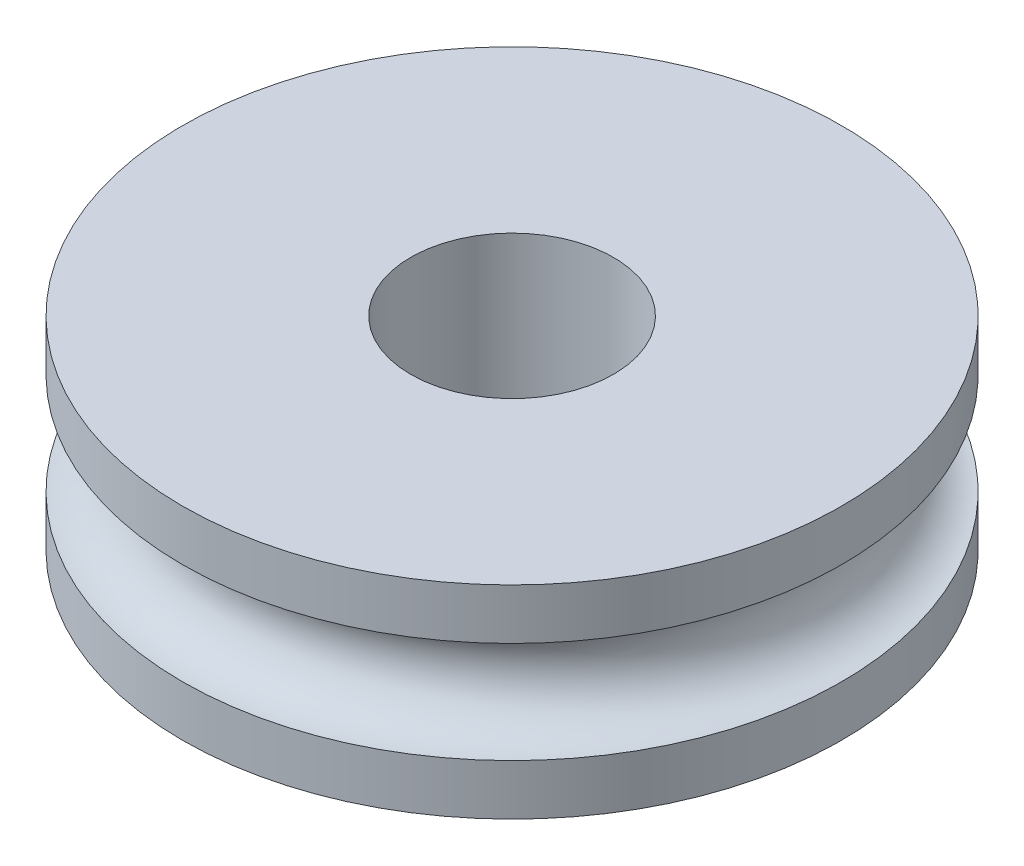
ISO-10303-21;
HEADER;
FILE_DESCRIPTION(('STEP AP214'),'2;1');
FILE_NAME('part.step','',(''),(''),'','','');
FILE_SCHEMA(('AUTOMOTIVE_DESIGN { 1 0 10303 214 1 1 1 1 }'));
ENDSEC;
DATA;
#1=APPLICATION_CONTEXT('core data for automotive mechanical design processes');
#2=APPLICATION_PROTOCOL_DEFINITION('international standard','automotive_design',2000,#1);
#3=PRODUCT_CONTEXT('',#1,'mechanical');
#4=PRODUCT('Part','Part','',(#3));
#5=PRODUCT_RELATED_PRODUCT_CATEGORY('part','',(#4));
#6=PRODUCT_DEFINITION_FORMATION('','',#4);
#7=PRODUCT_DEFINITION_CONTEXT('part definition',#1,'design');
#8=PRODUCT_DEFINITION('design','',#6,#7);
#9=PRODUCT_DEFINITION_SHAPE('','',#8);
#10=(LENGTH_UNIT() NAMED_UNIT(*) SI_UNIT(.MILLI.,.METRE.));
#11=(NAMED_UNIT(*) PLANE_ANGLE_UNIT() SI_UNIT($,.RADIAN.));
#12=(NAMED_UNIT(*) SI_UNIT($,.STERADIAN.) SOLID_ANGLE_UNIT());
#13=UNCERTAINTY_MEASURE_WITH_UNIT(LENGTH_MEASURE(1.E-05),#10,'distance_accuracy_value','');
#14=(GEOMETRIC_REPRESENTATION_CONTEXT(3) GLOBAL_UNCERTAINTY_ASSIGNED_CONTEXT((#13)) GLOBAL_UNIT_ASSIGNED_CONTEXT((#10,
#11,#12)) REPRESENTATION_CONTEXT('',''));
#15=CARTESIAN_POINT('',(0.,0.,0.));
#16=DIRECTION('',(0.,0.,1.));
#17=DIRECTION('',(1.,0.,0.));
#18=AXIS2_PLACEMENT_3D('',#15,#16,#17);
#19=CARTESIAN_POINT('',(74.5,50.02643198464,-44.43));
#20=DIRECTION('',(0.,1.,0.));
#21=DIRECTION('',(0.,0.,1.));
#22=AXIS2_PLACEMENT_3D('',#19,#20,#21);
#23=CYLINDRICAL_SURFACE('',#22,6.50000000000001);
#24=CARTESIAN_POINT('',(74.5,54.52643198464,-44.43));
#25=DIRECTION('',(0.,1.,0.));
#26=DIRECTION('',(0.,0.,1.));
#27=AXIS2_PLACEMENT_3D('',#24,#25,#26);
#28=CIRCLE('',#27,6.50000000000001);
#29=CARTESIAN_POINT('',(74.5,54.52643198464,-37.93));
#30=VERTEX_POINT('',#29);
#31=EDGE_CURVE('E19',#30,#30,#28,.F.);
#32=ORIENTED_EDGE('',*,*,#31,.T.);
#33=EDGE_LOOP('',(#32));
#34=FACE_BOUND('',#33,.T.);
#35=CARTESIAN_POINT('',(74.5,53.52643198464,-44.43));
#36=DIRECTION('',(0.,1.,0.));
#37=DIRECTION('',(0.,0.,1.));
#38=AXIS2_PLACEMENT_3D('',#35,#36,#37);
#39=CIRCLE('',#38,6.50000000000001);
#40=CARTESIAN_POINT('',(74.5,53.52643198464,-37.93));
#41=VERTEX_POINT('',#40);
#42=EDGE_CURVE('E34',#41,#41,#39,.T.);
#43=ORIENTED_EDGE('',*,*,#42,.T.);
#44=EDGE_LOOP('',(#43));
#45=FACE_BOUND('',#44,.T.);
#46=ADVANCED_FACE('F16',(#34,#45),#23,.T.);
#47=CARTESIAN_POINT('',(74.5,52.52643198464,-44.43));
#48=DIRECTION('',(0.,1.,0.));
#49=DIRECTION('',(1.,0.,0.));
#50=AXIS2_PLACEMENT_3D('',#47,#48,#49);
#51=TOROIDAL_SURFACE('',#50,6.50000000000001,1.);
#52=ORIENTED_EDGE('',*,*,#42,.F.);
#53=EDGE_LOOP('',(#52));
#54=FACE_BOUND('',#53,.T.);
#55=CARTESIAN_POINT('',(74.5,51.52643198464,-44.43));
#56=DIRECTION('',(0.,1.,0.));
#57=DIRECTION('',(0.,0.,1.));
#58=AXIS2_PLACEMENT_3D('',#55,#56,#57);
#59=CIRCLE('',#58,6.50000000000001);
#60=CARTESIAN_POINT('',(74.5,51.52643198464,-37.93));
#61=VERTEX_POINT('',#60);
#62=EDGE_CURVE('E38',#61,#61,#59,.F.);
#63=ORIENTED_EDGE('',*,*,#62,.F.);
#64=EDGE_LOOP('',(#63));
#65=FACE_BOUND('',#64,.T.);
#66=ADVANCED_FACE('F49',(#54,#65),#51,.F.);
#67=CARTESIAN_POINT('',(83.5,54.52643198464,-52.35926627001));
#68=DIRECTION('',(0.,-1.,0.));
#69=DIRECTION('',(0.,0.,-1.));
#70=AXIS2_PLACEMENT_3D('',#67,#68,#69);
#71=PLANE('',#70);
#72=CARTESIAN_POINT('',(74.5,54.52643198464,-44.43));
#73=DIRECTION('',(0.,1.,0.));
#74=DIRECTION('',(0.,0.,1.));
#75=AXIS2_PLACEMENT_3D('',#72,#73,#74);
#76=CIRCLE('',#75,2.);
#77=CARTESIAN_POINT('',(74.5,54.52643198464,-42.43));
#78=VERTEX_POINT('',#77);
#79=EDGE_CURVE('E31',#78,#78,#76,.F.);
#80=ORIENTED_EDGE('',*,*,#79,.T.);
#81=EDGE_LOOP('',(#80));
#82=FACE_BOUND('',#81,.T.);
#83=ORIENTED_EDGE('',*,*,#31,.F.);
#84=EDGE_LOOP('',(#83));
#85=FACE_BOUND('',#84,.T.);
#86=ADVANCED_FACE('F52',(#82,#85),#71,.F.);
#87=CARTESIAN_POINT('',(74.5,50.02643198464,-44.43));
#88=DIRECTION('',(0.,1.,0.));
#89=DIRECTION('',(0.,0.,1.));
#90=AXIS2_PLACEMENT_3D('',#87,#88,#89);
#91=CYLINDRICAL_SURFACE('',#90,6.50000000000001);
#92=CARTESIAN_POINT('',(74.5,50.52643198464,-44.43));
#93=DIRECTION('',(0.,1.,0.));
#94=DIRECTION('',(0.,0.,1.));
#95=AXIS2_PLACEMENT_3D('',#92,#93,#94);
#96=CIRCLE('',#95,6.50000000000001);
#97=CARTESIAN_POINT('',(74.5,50.52643198464,-37.93));
#98=VERTEX_POINT('',#97);
#99=EDGE_CURVE('E24',#98,#98,#96,.T.);
#100=ORIENTED_EDGE('',*,*,#99,.T.);
#101=EDGE_LOOP('',(#100));
#102=FACE_BOUND('',#101,.T.);
#103=ORIENTED_EDGE('',*,*,#62,.T.);
#104=EDGE_LOOP('',(#103));
#105=FACE_BOUND('',#104,.T.);
#106=ADVANCED_FACE('F58',(#102,#105),#91,.T.);
#107=CARTESIAN_POINT('',(74.5,50.02643198464,-44.43));
#108=DIRECTION('',(0.,1.,0.));
#109=DIRECTION('',(0.,0.,1.));
#110=AXIS2_PLACEMENT_3D('',#107,#108,#109);
#111=CYLINDRICAL_SURFACE('',#110,2.);
#112=CARTESIAN_POINT('',(74.5,50.52643198464,-44.43));
#113=DIRECTION('',(0.,1.,0.));
#114=DIRECTION('',(0.,0.,1.));
#115=AXIS2_PLACEMENT_3D('',#112,#113,#114);
#116=CIRCLE('',#115,2.);
#117=CARTESIAN_POINT('',(74.5,50.52643198464,-42.43));
#118=VERTEX_POINT('',#117);
#119=EDGE_CURVE('E10',#118,#118,#116,.F.);
#120=ORIENTED_EDGE('',*,*,#119,.T.);
#121=EDGE_LOOP('',(#120));
#122=FACE_BOUND('',#121,.T.);
#123=ORIENTED_EDGE('',*,*,#79,.F.);
#124=EDGE_LOOP('',(#123));
#125=FACE_BOUND('',#124,.T.);
#126=ADVANCED_FACE('F61',(#122,#125),#111,.F.);
#127=CARTESIAN_POINT('',(83.5,50.52643198464,-37.31836938706));
#128=DIRECTION('',(0.,1.,0.));
#129=DIRECTION('',(0.,0.,1.));
#130=AXIS2_PLACEMENT_3D('',#127,#128,#129);
#131=PLANE('',#130);
#132=ORIENTED_EDGE('',*,*,#119,.F.);
#133=EDGE_LOOP('',(#132));
#134=FACE_BOUND('',#133,.T.);
#135=ORIENTED_EDGE('',*,*,#99,.F.);
#136=EDGE_LOOP('',(#135));
#137=FACE_BOUND('',#136,.T.);
#138=ADVANCED_FACE('F65',(#134,#137),#131,.F.);
#139=CLOSED_SHELL('',(#46,#66,#86,#106,#126,#138));
#140=MANIFOLD_SOLID_BREP('B1',#139);
#141=ADVANCED_BREP_SHAPE_REPRESENTATION('',(#18,#140),#14);
#142=SHAPE_DEFINITION_REPRESENTATION(#9,#141);
ENDSEC;
END-ISO-10303-21;
